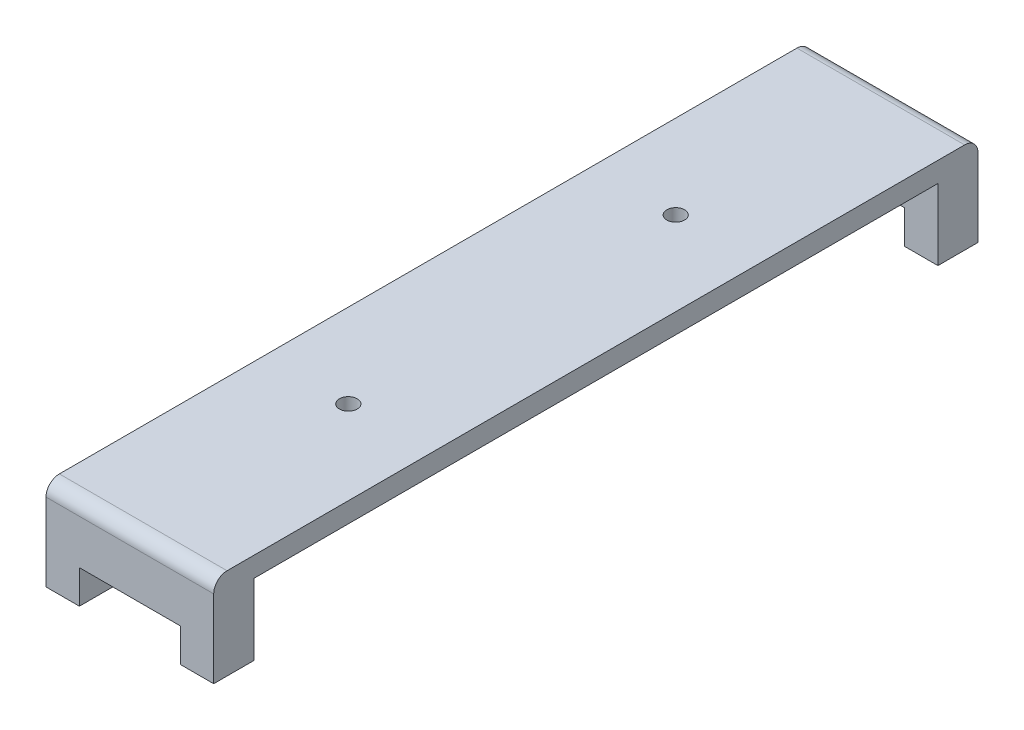
ISO-10303-21;
HEADER;
FILE_DESCRIPTION(('STEP AP214'),'2;1');
FILE_NAME('part.step','',(''),(''),'','','');
FILE_SCHEMA(('AUTOMOTIVE_DESIGN { 1 0 10303 214 1 1 1 1 }'));
ENDSEC;
DATA;
#1=APPLICATION_CONTEXT('core data for automotive mechanical design processes');
#2=APPLICATION_PROTOCOL_DEFINITION('international standard','automotive_design',2000,#1);
#3=PRODUCT_CONTEXT('',#1,'mechanical');
#4=PRODUCT('Part','Part','',(#3));
#5=PRODUCT_RELATED_PRODUCT_CATEGORY('part','',(#4));
#6=PRODUCT_DEFINITION_FORMATION('','',#4);
#7=PRODUCT_DEFINITION_CONTEXT('part definition',#1,'design');
#8=PRODUCT_DEFINITION('design','',#6,#7);
#9=PRODUCT_DEFINITION_SHAPE('','',#8);
#10=(LENGTH_UNIT() NAMED_UNIT(*) SI_UNIT(.MILLI.,.METRE.));
#11=(NAMED_UNIT(*) PLANE_ANGLE_UNIT() SI_UNIT($,.RADIAN.));
#12=(NAMED_UNIT(*) SI_UNIT($,.STERADIAN.) SOLID_ANGLE_UNIT());
#13=UNCERTAINTY_MEASURE_WITH_UNIT(LENGTH_MEASURE(1.E-05),#10,'distance_accuracy_value','');
#14=(GEOMETRIC_REPRESENTATION_CONTEXT(3) GLOBAL_UNCERTAINTY_ASSIGNED_CONTEXT((#13)) GLOBAL_UNIT_ASSIGNED_CONTEXT((#10,
#11,#12)) REPRESENTATION_CONTEXT('',''));
#15=CARTESIAN_POINT('',(0.,0.,0.));
#16=DIRECTION('',(0.,0.,1.));
#17=DIRECTION('',(1.,0.,0.));
#18=AXIS2_PLACEMENT_3D('',#15,#16,#17);
#19=CARTESIAN_POINT('',(0.,0.,0.));
#20=DIRECTION('',(0.,1.,0.));
#21=DIRECTION('',(0.,0.,1.));
#22=AXIS2_PLACEMENT_3D('',#19,#20,#21);
#23=PLANE('',#22);
#24=CARTESIAN_POINT('',(0.,0.,24.5));
#25=DIRECTION('',(0.,-1.,0.));
#26=DIRECTION('',(0.,0.,-1.));
#27=AXIS2_PLACEMENT_3D('',#24,#25,#26);
#28=CIRCLE('',#27,1.335);
#29=CARTESIAN_POINT('',(0.,0.,23.165));
#30=VERTEX_POINT('',#29);
#31=EDGE_CURVE('E213',#30,#30,#28,.T.);
#32=ORIENTED_EDGE('',*,*,#31,.F.);
#33=EDGE_LOOP('',(#32));
#34=FACE_BOUND('',#33,.T.);
#35=CARTESIAN_POINT('',(0.,0.,-24.5));
#36=DIRECTION('',(0.,1.,0.));
#37=DIRECTION('',(0.,0.,1.));
#38=AXIS2_PLACEMENT_3D('',#35,#36,#37);
#39=CIRCLE('',#38,1.335);
#40=CARTESIAN_POINT('',(0.,0.,-23.165));
#41=VERTEX_POINT('',#40);
#42=EDGE_CURVE('E310',#41,#41,#39,.T.);
#43=ORIENTED_EDGE('',*,*,#42,.T.);
#44=EDGE_LOOP('',(#43));
#45=FACE_BOUND('',#44,.T.);
#46=DIRECTION('',(-1.,0.,0.));
#47=VECTOR('',#46,1.);
#48=CARTESIAN_POINT('',(0.,0.,51.2));
#49=LINE('',#48,#47);
#50=CARTESIAN_POINT('',(12.55,0.,51.2));
#51=VERTEX_POINT('',#50);
#52=CARTESIAN_POINT('',(-12.55,0.,51.2));
#53=VERTEX_POINT('',#52);
#54=EDGE_CURVE('E194',#51,#53,#49,.T.);
#55=ORIENTED_EDGE('',*,*,#54,.T.);
#56=DIRECTION('',(0.,0.,1.));
#57=VECTOR('',#56,1.);
#58=CARTESIAN_POINT('',(-12.55,0.,0.));
#59=LINE('',#58,#57);
#60=CARTESIAN_POINT('',(-12.55,0.,-51.2));
#61=VERTEX_POINT('',#60);
#62=EDGE_CURVE('E252',#61,#53,#59,.T.);
#63=ORIENTED_EDGE('',*,*,#62,.F.);
#64=DIRECTION('',(-1.,0.,0.));
#65=VECTOR('',#64,1.);
#66=CARTESIAN_POINT('',(0.,0.,-51.2));
#67=LINE('',#66,#65);
#68=CARTESIAN_POINT('',(12.55,0.,-51.2));
#69=VERTEX_POINT('',#68);
#70=EDGE_CURVE('E247',#69,#61,#67,.T.);
#71=ORIENTED_EDGE('',*,*,#70,.F.);
#72=DIRECTION('',(0.,0.,1.));
#73=VECTOR('',#72,1.);
#74=CARTESIAN_POINT('',(12.55,0.,0.));
#75=LINE('',#74,#73);
#76=EDGE_CURVE('E313',#69,#51,#75,.T.);
#77=ORIENTED_EDGE('',*,*,#76,.T.);
#78=EDGE_LOOP('',(#55,#63,#71,#77));
#79=FACE_BOUND('',#78,.T.);
#80=ADVANCED_FACE('F33',(#34,#45,#79),#23,.F.);
#81=CARTESIAN_POINT('',(12.55,3.,0.));
#82=DIRECTION('',(1.,0.,0.));
#83=DIRECTION('',(0.,0.,-1.));
#84=AXIS2_PLACEMENT_3D('',#81,#82,#83);
#85=PLANE('',#84);
#86=DIRECTION('',(0.,-1.,0.));
#87=VECTOR('',#86,1.);
#88=CARTESIAN_POINT('',(12.55,3.,-57.2));
#89=LINE('',#88,#87);
#90=CARTESIAN_POINT('',(12.55,1.,-57.2));
#91=VERTEX_POINT('',#90);
#92=CARTESIAN_POINT('',(12.55,-10.65,-57.2));
#93=VERTEX_POINT('',#92);
#94=EDGE_CURVE('E266',#91,#93,#89,.T.);
#95=ORIENTED_EDGE('',*,*,#94,.F.);
#96=CARTESIAN_POINT('',(12.55,1.,-55.2));
#97=DIRECTION('',(1.,0.,0.));
#98=DIRECTION('',(0.,0.,-1.));
#99=AXIS2_PLACEMENT_3D('',#96,#97,#98);
#100=CIRCLE('',#99,2.);
#101=CARTESIAN_POINT('',(12.55,3.,-55.2));
#102=VERTEX_POINT('',#101);
#103=EDGE_CURVE('E268',#91,#102,#100,.T.);
#104=ORIENTED_EDGE('',*,*,#103,.T.);
#105=DIRECTION('',(0.,0.,1.));
#106=VECTOR('',#105,1.);
#107=CARTESIAN_POINT('',(12.55,3.,0.));
#108=LINE('',#107,#106);
#109=CARTESIAN_POINT('',(12.55,3.,55.2));
#110=VERTEX_POINT('',#109);
#111=EDGE_CURVE('E297',#102,#110,#108,.T.);
#112=ORIENTED_EDGE('',*,*,#111,.T.);
#113=CARTESIAN_POINT('',(12.55,1.,55.2));
#114=DIRECTION('',(1.,0.,0.));
#115=DIRECTION('',(0.,0.,-1.));
#116=AXIS2_PLACEMENT_3D('',#113,#114,#115);
#117=CIRCLE('',#116,2.);
#118=CARTESIAN_POINT('',(12.55,1.,57.2));
#119=VERTEX_POINT('',#118);
#120=EDGE_CURVE('E265',#110,#119,#117,.T.);
#121=ORIENTED_EDGE('',*,*,#120,.T.);
#122=DIRECTION('',(0.,-1.,0.));
#123=VECTOR('',#122,1.);
#124=CARTESIAN_POINT('',(12.55,3.,57.2));
#125=LINE('',#124,#123);
#126=CARTESIAN_POINT('',(12.55,-10.65,57.2));
#127=VERTEX_POINT('',#126);
#128=EDGE_CURVE('E226',#119,#127,#125,.T.);
#129=ORIENTED_EDGE('',*,*,#128,.T.);
#130=DIRECTION('',(0.,0.,1.));
#131=VECTOR('',#130,1.);
#132=CARTESIAN_POINT('',(12.55,-10.65,51.2));
#133=LINE('',#132,#131);
#134=CARTESIAN_POINT('',(12.55,-10.65,51.2));
#135=VERTEX_POINT('',#134);
#136=EDGE_CURVE('E219',#135,#127,#133,.T.);
#137=ORIENTED_EDGE('',*,*,#136,.F.);
#138=DIRECTION('',(0.,1.,0.));
#139=VECTOR('',#138,1.);
#140=CARTESIAN_POINT('',(12.55,0.,51.2));
#141=LINE('',#140,#139);
#142=EDGE_CURVE('E191',#135,#51,#141,.T.);
#143=ORIENTED_EDGE('',*,*,#142,.T.);
#144=ORIENTED_EDGE('',*,*,#76,.F.);
#145=DIRECTION('',(0.,1.,0.));
#146=VECTOR('',#145,1.);
#147=CARTESIAN_POINT('',(12.55,0.,-51.2));
#148=LINE('',#147,#146);
#149=CARTESIAN_POINT('',(12.55,-10.65,-51.2));
#150=VERTEX_POINT('',#149);
#151=EDGE_CURVE('E251',#150,#69,#148,.T.);
#152=ORIENTED_EDGE('',*,*,#151,.F.);
#153=DIRECTION('',(0.,0.,-1.));
#154=VECTOR('',#153,1.);
#155=CARTESIAN_POINT('',(12.55,-10.65,-51.2));
#156=LINE('',#155,#154);
#157=EDGE_CURVE('E327',#150,#93,#156,.T.);
#158=ORIENTED_EDGE('',*,*,#157,.T.);
#159=EDGE_LOOP('',(#95,#104,#112,#121,#129,#137,#143,#144,#152,#158));
#160=FACE_BOUND('',#159,.T.);
#161=ADVANCED_FACE('F296',(#160),#85,.T.);
#162=CARTESIAN_POINT('',(0.,3.,-57.2));
#163=DIRECTION('',(0.,0.,-1.));
#164=DIRECTION('',(-1.,0.,0.));
#165=AXIS2_PLACEMENT_3D('',#162,#163,#164);
#166=PLANE('',#165);
#167=DIRECTION('',(0.,-1.,0.));
#168=VECTOR('',#167,1.);
#169=CARTESIAN_POINT('',(-12.55,3.,-57.2));
#170=LINE('',#169,#168);
#171=CARTESIAN_POINT('',(-12.55,1.,-57.2));
#172=VERTEX_POINT('',#171);
#173=CARTESIAN_POINT('',(-12.55,-10.65,-57.2));
#174=VERTEX_POINT('',#173);
#175=EDGE_CURVE('E279',#172,#174,#170,.T.);
#176=ORIENTED_EDGE('',*,*,#175,.F.);
#177=DIRECTION('',(1.,0.,0.));
#178=VECTOR('',#177,1.);
#179=CARTESIAN_POINT('',(0.,1.,-57.2));
#180=LINE('',#179,#178);
#181=EDGE_CURVE('E262',#172,#91,#180,.T.);
#182=ORIENTED_EDGE('',*,*,#181,.T.);
#183=ORIENTED_EDGE('',*,*,#94,.T.);
#184=DIRECTION('',(1.,0.,0.));
#185=VECTOR('',#184,1.);
#186=CARTESIAN_POINT('',(0.,-10.65,-57.2));
#187=LINE('',#186,#185);
#188=CARTESIAN_POINT('',(7.55,-10.65,-57.2));
#189=VERTEX_POINT('',#188);
#190=EDGE_CURVE('E321',#189,#93,#187,.T.);
#191=ORIENTED_EDGE('',*,*,#190,.F.);
#192=DIRECTION('',(0.,-1.,0.));
#193=VECTOR('',#192,1.);
#194=CARTESIAN_POINT('',(7.55,0.,-57.2));
#195=LINE('',#194,#193);
#196=CARTESIAN_POINT('',(7.55,-5.65,-57.2));
#197=VERTEX_POINT('',#196);
#198=EDGE_CURVE('E237',#197,#189,#195,.T.);
#199=ORIENTED_EDGE('',*,*,#198,.F.);
#200=DIRECTION('',(1.,0.,0.));
#201=VECTOR('',#200,1.);
#202=CARTESIAN_POINT('',(0.,-5.65,-57.2));
#203=LINE('',#202,#201);
#204=CARTESIAN_POINT('',(-7.55,-5.65,-57.2));
#205=VERTEX_POINT('',#204);
#206=EDGE_CURVE('E232',#205,#197,#203,.T.);
#207=ORIENTED_EDGE('',*,*,#206,.F.);
#208=DIRECTION('',(0.,1.,0.));
#209=VECTOR('',#208,1.);
#210=CARTESIAN_POINT('',(-7.55,0.,-57.2));
#211=LINE('',#210,#209);
#212=CARTESIAN_POINT('',(-7.55,-10.65,-57.2));
#213=VERTEX_POINT('',#212);
#214=EDGE_CURVE('E352',#213,#205,#211,.T.);
#215=ORIENTED_EDGE('',*,*,#214,.F.);
#216=DIRECTION('',(1.,0.,0.));
#217=VECTOR('',#216,1.);
#218=CARTESIAN_POINT('',(0.,-10.65,-57.2));
#219=LINE('',#218,#217);
#220=EDGE_CURVE('E290',#174,#213,#219,.T.);
#221=ORIENTED_EDGE('',*,*,#220,.F.);
#222=EDGE_LOOP('',(#176,#182,#183,#191,#199,#207,#215,#221));
#223=FACE_BOUND('',#222,.T.);
#224=ADVANCED_FACE('F287',(#223),#166,.T.);
#225=CARTESIAN_POINT('',(-12.55,3.,0.));
#226=DIRECTION('',(1.,0.,0.));
#227=DIRECTION('',(0.,0.,-1.));
#228=AXIS2_PLACEMENT_3D('',#225,#226,#227);
#229=PLANE('',#228);
#230=DIRECTION('',(0.,0.,1.));
#231=VECTOR('',#230,1.);
#232=CARTESIAN_POINT('',(-12.55,3.,0.));
#233=LINE('',#232,#231);
#234=CARTESIAN_POINT('',(-12.55,3.,-55.2));
#235=VERTEX_POINT('',#234);
#236=CARTESIAN_POINT('',(-12.55,3.,55.2));
#237=VERTEX_POINT('',#236);
#238=EDGE_CURVE('E281',#235,#237,#233,.T.);
#239=ORIENTED_EDGE('',*,*,#238,.F.);
#240=CARTESIAN_POINT('',(-12.55,1.,-55.2));
#241=DIRECTION('',(1.,0.,0.));
#242=DIRECTION('',(0.,0.,-1.));
#243=AXIS2_PLACEMENT_3D('',#240,#241,#242);
#244=CIRCLE('',#243,2.);
#245=EDGE_CURVE('E41',#235,#172,#244,.F.);
#246=ORIENTED_EDGE('',*,*,#245,.T.);
#247=ORIENTED_EDGE('',*,*,#175,.T.);
#248=DIRECTION('',(0.,0.,-1.));
#249=VECTOR('',#248,1.);
#250=CARTESIAN_POINT('',(-12.55,-10.65,-51.2));
#251=LINE('',#250,#249);
#252=CARTESIAN_POINT('',(-12.55,-10.65,-51.2));
#253=VERTEX_POINT('',#252);
#254=EDGE_CURVE('E333',#253,#174,#251,.T.);
#255=ORIENTED_EDGE('',*,*,#254,.F.);
#256=DIRECTION('',(0.,-1.,0.));
#257=VECTOR('',#256,1.);
#258=CARTESIAN_POINT('',(-12.55,0.,-51.2));
#259=LINE('',#258,#257);
#260=EDGE_CURVE('E241',#61,#253,#259,.T.);
#261=ORIENTED_EDGE('',*,*,#260,.F.);
#262=ORIENTED_EDGE('',*,*,#62,.T.);
#263=DIRECTION('',(0.,-1.,0.));
#264=VECTOR('',#263,1.);
#265=CARTESIAN_POINT('',(-12.55,0.,51.2));
#266=LINE('',#265,#264);
#267=CARTESIAN_POINT('',(-12.55,-10.65,51.2));
#268=VERTEX_POINT('',#267);
#269=EDGE_CURVE('E197',#53,#268,#266,.T.);
#270=ORIENTED_EDGE('',*,*,#269,.T.);
#271=DIRECTION('',(0.,0.,1.));
#272=VECTOR('',#271,1.);
#273=CARTESIAN_POINT('',(-12.55,-10.65,51.2));
#274=LINE('',#273,#272);
#275=CARTESIAN_POINT('',(-12.55,-10.65,57.2));
#276=VERTEX_POINT('',#275);
#277=EDGE_CURVE('E216',#268,#276,#274,.T.);
#278=ORIENTED_EDGE('',*,*,#277,.T.);
#279=DIRECTION('',(0.,-1.,0.));
#280=VECTOR('',#279,1.);
#281=CARTESIAN_POINT('',(-12.55,3.,57.2));
#282=LINE('',#281,#280);
#283=CARTESIAN_POINT('',(-12.55,1.,57.2));
#284=VERTEX_POINT('',#283);
#285=EDGE_CURVE('E230',#284,#276,#282,.T.);
#286=ORIENTED_EDGE('',*,*,#285,.F.);
#287=CARTESIAN_POINT('',(-12.55,1.,55.2));
#288=DIRECTION('',(1.,0.,0.));
#289=DIRECTION('',(0.,0.,-1.));
#290=AXIS2_PLACEMENT_3D('',#287,#288,#289);
#291=CIRCLE('',#290,2.);
#292=EDGE_CURVE('E53',#284,#237,#291,.F.);
#293=ORIENTED_EDGE('',*,*,#292,.T.);
#294=EDGE_LOOP('',(#239,#246,#247,#255,#261,#262,#270,#278,#286,#293));
#295=FACE_BOUND('',#294,.T.);
#296=ADVANCED_FACE('F277',(#295),#229,.F.);
#297=CARTESIAN_POINT('',(0.,3.,-24.5));
#298=DIRECTION('',(0.,-1.,0.));
#299=DIRECTION('',(0.,0.,-1.));
#300=AXIS2_PLACEMENT_3D('',#297,#298,#299);
#301=CYLINDRICAL_SURFACE('',#300,1.335);
#302=CARTESIAN_POINT('',(0.,3.,-24.5));
#303=DIRECTION('',(0.,1.,0.));
#304=DIRECTION('',(0.,0.,1.));
#305=AXIS2_PLACEMENT_3D('',#302,#303,#304);
#306=CIRCLE('',#305,1.335);
#307=CARTESIAN_POINT('',(0.,3.,-23.165));
#308=VERTEX_POINT('',#307);
#309=EDGE_CURVE('E303',#308,#308,#306,.T.);
#310=ORIENTED_EDGE('',*,*,#309,.T.);
#311=EDGE_LOOP('',(#310));
#312=FACE_BOUND('',#311,.T.);
#313=ORIENTED_EDGE('',*,*,#42,.F.);
#314=EDGE_LOOP('',(#313));
#315=FACE_BOUND('',#314,.T.);
#316=ADVANCED_FACE('F405',(#312,#315),#301,.F.);
#317=CARTESIAN_POINT('',(0.,3.,0.));
#318=DIRECTION('',(0.,1.,0.));
#319=DIRECTION('',(0.,0.,1.));
#320=AXIS2_PLACEMENT_3D('',#317,#318,#319);
#321=PLANE('',#320);
#322=ORIENTED_EDGE('',*,*,#309,.F.);
#323=EDGE_LOOP('',(#322));
#324=FACE_BOUND('',#323,.T.);
#325=ORIENTED_EDGE('',*,*,#111,.F.);
#326=DIRECTION('',(1.,0.,0.));
#327=VECTOR('',#326,1.);
#328=CARTESIAN_POINT('',(0.,3.,-55.2));
#329=LINE('',#328,#327);
#330=EDGE_CURVE('E273',#102,#235,#329,.F.);
#331=ORIENTED_EDGE('',*,*,#330,.T.);
#332=ORIENTED_EDGE('',*,*,#238,.T.);
#333=DIRECTION('',(1.,0.,0.));
#334=VECTOR('',#333,1.);
#335=CARTESIAN_POINT('',(12.55,3.,55.2));
#336=LINE('',#335,#334);
#337=EDGE_CURVE('E270',#237,#110,#336,.T.);
#338=ORIENTED_EDGE('',*,*,#337,.T.);
#339=EDGE_LOOP('',(#325,#331,#332,#338));
#340=FACE_BOUND('',#339,.T.);
#341=CARTESIAN_POINT('',(0.,3.,24.5));
#342=DIRECTION('',(0.,-1.,0.));
#343=DIRECTION('',(0.,0.,-1.));
#344=AXIS2_PLACEMENT_3D('',#341,#342,#343);
#345=CIRCLE('',#344,1.335);
#346=CARTESIAN_POINT('',(0.,3.,23.165));
#347=VERTEX_POINT('',#346);
#348=EDGE_CURVE('E223',#347,#347,#345,.T.);
#349=ORIENTED_EDGE('',*,*,#348,.T.);
#350=EDGE_LOOP('',(#349));
#351=FACE_BOUND('',#350,.T.);
#352=ADVANCED_FACE('F300',(#324,#340,#351),#321,.T.);
#353=CARTESIAN_POINT('',(0.,-5.65,-51.2));
#354=DIRECTION('',(0.,1.,0.));
#355=DIRECTION('',(-1.,0.,0.));
#356=AXIS2_PLACEMENT_3D('',#353,#354,#355);
#357=PLANE('',#356);
#358=ORIENTED_EDGE('',*,*,#206,.T.);
#359=DIRECTION('',(0.,0.,-1.));
#360=VECTOR('',#359,1.);
#361=CARTESIAN_POINT('',(7.55,-5.65,-51.2));
#362=LINE('',#361,#360);
#363=CARTESIAN_POINT('',(7.55,-5.65,-51.2));
#364=VERTEX_POINT('',#363);
#365=EDGE_CURVE('E314',#364,#197,#362,.T.);
#366=ORIENTED_EDGE('',*,*,#365,.F.);
#367=DIRECTION('',(1.,0.,0.));
#368=VECTOR('',#367,1.);
#369=CARTESIAN_POINT('',(0.,-5.65,-51.2));
#370=LINE('',#369,#368);
#371=CARTESIAN_POINT('',(-7.55,-5.65,-51.2));
#372=VERTEX_POINT('',#371);
#373=EDGE_CURVE('E233',#372,#364,#370,.T.);
#374=ORIENTED_EDGE('',*,*,#373,.F.);
#375=DIRECTION('',(0.,0.,-1.));
#376=VECTOR('',#375,1.);
#377=CARTESIAN_POINT('',(-7.55,-5.65,-51.2));
#378=LINE('',#377,#376);
#379=EDGE_CURVE('E341',#372,#205,#378,.T.);
#380=ORIENTED_EDGE('',*,*,#379,.T.);
#381=EDGE_LOOP('',(#358,#366,#374,#380));
#382=FACE_BOUND('',#381,.T.);
#383=ADVANCED_FACE('F359',(#382),#357,.F.);
#384=CARTESIAN_POINT('',(7.55,0.,-51.2));
#385=DIRECTION('',(1.,0.,0.));
#386=DIRECTION('',(0.,0.,-1.));
#387=AXIS2_PLACEMENT_3D('',#384,#385,#386);
#388=PLANE('',#387);
#389=ORIENTED_EDGE('',*,*,#198,.T.);
#390=DIRECTION('',(0.,0.,-1.));
#391=VECTOR('',#390,1.);
#392=CARTESIAN_POINT('',(7.55,-10.65,-51.2));
#393=LINE('',#392,#391);
#394=CARTESIAN_POINT('',(7.55,-10.65,-51.2));
#395=VERTEX_POINT('',#394);
#396=EDGE_CURVE('E330',#395,#189,#393,.T.);
#397=ORIENTED_EDGE('',*,*,#396,.F.);
#398=DIRECTION('',(0.,-1.,0.));
#399=VECTOR('',#398,1.);
#400=CARTESIAN_POINT('',(7.55,0.,-51.2));
#401=LINE('',#400,#399);
#402=EDGE_CURVE('E343',#364,#395,#401,.T.);
#403=ORIENTED_EDGE('',*,*,#402,.F.);
#404=ORIENTED_EDGE('',*,*,#365,.T.);
#405=EDGE_LOOP('',(#389,#397,#403,#404));
#406=FACE_BOUND('',#405,.T.);
#407=ADVANCED_FACE('F358',(#406),#388,.F.);
#408=CARTESIAN_POINT('',(0.,-10.65,-51.2));
#409=DIRECTION('',(0.,1.,0.));
#410=DIRECTION('',(-1.,0.,0.));
#411=AXIS2_PLACEMENT_3D('',#408,#409,#410);
#412=PLANE('',#411);
#413=ORIENTED_EDGE('',*,*,#190,.T.);
#414=ORIENTED_EDGE('',*,*,#157,.F.);
#415=DIRECTION('',(1.,0.,0.));
#416=VECTOR('',#415,1.);
#417=CARTESIAN_POINT('',(0.,-10.65,-51.2));
#418=LINE('',#417,#416);
#419=EDGE_CURVE('E244',#395,#150,#418,.T.);
#420=ORIENTED_EDGE('',*,*,#419,.F.);
#421=ORIENTED_EDGE('',*,*,#396,.T.);
#422=EDGE_LOOP('',(#413,#414,#420,#421));
#423=FACE_BOUND('',#422,.T.);
#424=ADVANCED_FACE('F325',(#423),#412,.F.);
#425=CARTESIAN_POINT('',(0.,-10.65,-51.2));
#426=DIRECTION('',(0.,1.,0.));
#427=DIRECTION('',(0.,0.,1.));
#428=AXIS2_PLACEMENT_3D('',#425,#426,#427);
#429=PLANE('',#428);
#430=ORIENTED_EDGE('',*,*,#220,.T.);
#431=DIRECTION('',(0.,0.,-1.));
#432=VECTOR('',#431,1.);
#433=CARTESIAN_POINT('',(-7.55,-10.65,-51.2));
#434=LINE('',#433,#432);
#435=CARTESIAN_POINT('',(-7.55,-10.65,-51.2));
#436=VERTEX_POINT('',#435);
#437=EDGE_CURVE('E336',#436,#213,#434,.T.);
#438=ORIENTED_EDGE('',*,*,#437,.F.);
#439=DIRECTION('',(1.,0.,0.));
#440=VECTOR('',#439,1.);
#441=CARTESIAN_POINT('',(0.,-10.65,-51.2));
#442=LINE('',#441,#440);
#443=EDGE_CURVE('E239',#253,#436,#442,.T.);
#444=ORIENTED_EDGE('',*,*,#443,.F.);
#445=ORIENTED_EDGE('',*,*,#254,.T.);
#446=EDGE_LOOP('',(#430,#438,#444,#445));
#447=FACE_BOUND('',#446,.T.);
#448=ADVANCED_FACE('F366',(#447),#429,.F.);
#449=CARTESIAN_POINT('',(-7.55,0.,-51.2));
#450=DIRECTION('',(-1.,0.,0.));
#451=DIRECTION('',(0.,-1.,0.));
#452=AXIS2_PLACEMENT_3D('',#449,#450,#451);
#453=PLANE('',#452);
#454=ORIENTED_EDGE('',*,*,#214,.T.);
#455=ORIENTED_EDGE('',*,*,#379,.F.);
#456=DIRECTION('',(0.,1.,0.));
#457=VECTOR('',#456,1.);
#458=CARTESIAN_POINT('',(-7.55,0.,-51.2));
#459=LINE('',#458,#457);
#460=EDGE_CURVE('E236',#436,#372,#459,.T.);
#461=ORIENTED_EDGE('',*,*,#460,.F.);
#462=ORIENTED_EDGE('',*,*,#437,.T.);
#463=EDGE_LOOP('',(#454,#455,#461,#462));
#464=FACE_BOUND('',#463,.T.);
#465=ADVANCED_FACE('F361',(#464),#453,.F.);
#466=CARTESIAN_POINT('',(0.,0.,-51.2));
#467=DIRECTION('',(0.,0.,-1.));
#468=DIRECTION('',(-1.,0.,0.));
#469=AXIS2_PLACEMENT_3D('',#466,#467,#468);
#470=PLANE('',#469);
#471=ORIENTED_EDGE('',*,*,#373,.T.);
#472=ORIENTED_EDGE('',*,*,#402,.T.);
#473=ORIENTED_EDGE('',*,*,#419,.T.);
#474=ORIENTED_EDGE('',*,*,#151,.T.);
#475=ORIENTED_EDGE('',*,*,#70,.T.);
#476=ORIENTED_EDGE('',*,*,#260,.T.);
#477=ORIENTED_EDGE('',*,*,#443,.T.);
#478=ORIENTED_EDGE('',*,*,#460,.T.);
#479=EDGE_LOOP('',(#471,#472,#473,#474,#475,#476,#477,#478));
#480=FACE_BOUND('',#479,.T.);
#481=ADVANCED_FACE('F369',(#480),#470,.F.);
#482=CARTESIAN_POINT('',(0.,3.,24.5));
#483=DIRECTION('',(0.,-1.,0.));
#484=DIRECTION('',(0.,0.,-1.));
#485=AXIS2_PLACEMENT_3D('',#482,#483,#484);
#486=CYLINDRICAL_SURFACE('',#485,1.335);
#487=ORIENTED_EDGE('',*,*,#348,.F.);
#488=EDGE_LOOP('',(#487));
#489=FACE_BOUND('',#488,.T.);
#490=ORIENTED_EDGE('',*,*,#31,.T.);
#491=EDGE_LOOP('',(#490));
#492=FACE_BOUND('',#491,.T.);
#493=ADVANCED_FACE('F428',(#489,#492),#486,.F.);
#494=CARTESIAN_POINT('',(0.,3.,57.2));
#495=DIRECTION('',(0.,0.,-1.));
#496=DIRECTION('',(-1.,0.,0.));
#497=AXIS2_PLACEMENT_3D('',#494,#495,#496);
#498=PLANE('',#497);
#499=ORIENTED_EDGE('',*,*,#128,.F.);
#500=DIRECTION('',(1.,0.,0.));
#501=VECTOR('',#500,1.);
#502=CARTESIAN_POINT('',(-12.55,1.,57.2));
#503=LINE('',#502,#501);
#504=EDGE_CURVE('E11',#119,#284,#503,.F.);
#505=ORIENTED_EDGE('',*,*,#504,.T.);
#506=ORIENTED_EDGE('',*,*,#285,.T.);
#507=DIRECTION('',(1.,0.,0.));
#508=VECTOR('',#507,1.);
#509=CARTESIAN_POINT('',(0.,-10.65,57.2));
#510=LINE('',#509,#508);
#511=CARTESIAN_POINT('',(-7.55,-10.65,57.2));
#512=VERTEX_POINT('',#511);
#513=EDGE_CURVE('E187',#276,#512,#510,.T.);
#514=ORIENTED_EDGE('',*,*,#513,.T.);
#515=DIRECTION('',(0.,1.,0.));
#516=VECTOR('',#515,1.);
#517=CARTESIAN_POINT('',(-7.55,0.,57.2));
#518=LINE('',#517,#516);
#519=CARTESIAN_POINT('',(-7.55,-5.65,57.2));
#520=VERTEX_POINT('',#519);
#521=EDGE_CURVE('E184',#512,#520,#518,.T.);
#522=ORIENTED_EDGE('',*,*,#521,.T.);
#523=DIRECTION('',(1.,0.,0.));
#524=VECTOR('',#523,1.);
#525=CARTESIAN_POINT('',(0.,-5.65,57.2));
#526=LINE('',#525,#524);
#527=CARTESIAN_POINT('',(7.55,-5.65,57.2));
#528=VERTEX_POINT('',#527);
#529=EDGE_CURVE('E204',#520,#528,#526,.T.);
#530=ORIENTED_EDGE('',*,*,#529,.T.);
#531=DIRECTION('',(0.,-1.,0.));
#532=VECTOR('',#531,1.);
#533=CARTESIAN_POINT('',(7.55,0.,57.2));
#534=LINE('',#533,#532);
#535=CARTESIAN_POINT('',(7.55,-10.65,57.2));
#536=VERTEX_POINT('',#535);
#537=EDGE_CURVE('E163',#528,#536,#534,.T.);
#538=ORIENTED_EDGE('',*,*,#537,.T.);
#539=DIRECTION('',(1.,0.,0.));
#540=VECTOR('',#539,1.);
#541=CARTESIAN_POINT('',(0.,-10.65,57.2));
#542=LINE('',#541,#540);
#543=EDGE_CURVE('E207',#536,#127,#542,.T.);
#544=ORIENTED_EDGE('',*,*,#543,.T.);
#545=EDGE_LOOP('',(#499,#505,#506,#514,#522,#530,#538,#544));
#546=FACE_BOUND('',#545,.T.);
#547=ADVANCED_FACE('F374',(#546),#498,.F.);
#548=CARTESIAN_POINT('',(0.,-5.65,51.2));
#549=DIRECTION('',(0.,-1.,0.));
#550=DIRECTION('',(1.,0.,0.));
#551=AXIS2_PLACEMENT_3D('',#548,#549,#550);
#552=PLANE('',#551);
#553=ORIENTED_EDGE('',*,*,#529,.F.);
#554=DIRECTION('',(0.,0.,1.));
#555=VECTOR('',#554,1.);
#556=CARTESIAN_POINT('',(-7.55,-5.65,51.2));
#557=LINE('',#556,#555);
#558=CARTESIAN_POINT('',(-7.55,-5.65,51.2));
#559=VERTEX_POINT('',#558);
#560=EDGE_CURVE('E183',#559,#520,#557,.T.);
#561=ORIENTED_EDGE('',*,*,#560,.F.);
#562=DIRECTION('',(1.,0.,0.));
#563=VECTOR('',#562,1.);
#564=CARTESIAN_POINT('',(0.,-5.65,51.2));
#565=LINE('',#564,#563);
#566=CARTESIAN_POINT('',(7.55,-5.65,51.2));
#567=VERTEX_POINT('',#566);
#568=EDGE_CURVE('E176',#559,#567,#565,.T.);
#569=ORIENTED_EDGE('',*,*,#568,.T.);
#570=DIRECTION('',(0.,0.,1.));
#571=VECTOR('',#570,1.);
#572=CARTESIAN_POINT('',(7.55,-5.65,51.2));
#573=LINE('',#572,#571);
#574=EDGE_CURVE('E158',#567,#528,#573,.T.);
#575=ORIENTED_EDGE('',*,*,#574,.T.);
#576=EDGE_LOOP('',(#553,#561,#569,#575));
#577=FACE_BOUND('',#576,.T.);
#578=ADVANCED_FACE('F182',(#577),#552,.T.);
#579=CARTESIAN_POINT('',(-7.55,0.,51.2));
#580=DIRECTION('',(1.,0.,0.));
#581=DIRECTION('',(0.,1.,0.));
#582=AXIS2_PLACEMENT_3D('',#579,#580,#581);
#583=PLANE('',#582);
#584=ORIENTED_EDGE('',*,*,#521,.F.);
#585=DIRECTION('',(0.,0.,1.));
#586=VECTOR('',#585,1.);
#587=CARTESIAN_POINT('',(-7.55,-10.65,51.2));
#588=LINE('',#587,#586);
#589=CARTESIAN_POINT('',(-7.55,-10.65,51.2));
#590=VERTEX_POINT('',#589);
#591=EDGE_CURVE('E214',#590,#512,#588,.T.);
#592=ORIENTED_EDGE('',*,*,#591,.F.);
#593=DIRECTION('',(0.,1.,0.));
#594=VECTOR('',#593,1.);
#595=CARTESIAN_POINT('',(-7.55,0.,51.2));
#596=LINE('',#595,#594);
#597=EDGE_CURVE('E169',#590,#559,#596,.T.);
#598=ORIENTED_EDGE('',*,*,#597,.T.);
#599=ORIENTED_EDGE('',*,*,#560,.T.);
#600=EDGE_LOOP('',(#584,#592,#598,#599));
#601=FACE_BOUND('',#600,.T.);
#602=ADVANCED_FACE('F378',(#601),#583,.T.);
#603=CARTESIAN_POINT('',(0.,-10.65,51.2));
#604=DIRECTION('',(0.,-1.,0.));
#605=DIRECTION('',(0.,0.,-1.));
#606=AXIS2_PLACEMENT_3D('',#603,#604,#605);
#607=PLANE('',#606);
#608=ORIENTED_EDGE('',*,*,#513,.F.);
#609=ORIENTED_EDGE('',*,*,#277,.F.);
#610=DIRECTION('',(1.,0.,0.));
#611=VECTOR('',#610,1.);
#612=CARTESIAN_POINT('',(0.,-10.65,51.2));
#613=LINE('',#612,#611);
#614=EDGE_CURVE('E200',#268,#590,#613,.T.);
#615=ORIENTED_EDGE('',*,*,#614,.T.);
#616=ORIENTED_EDGE('',*,*,#591,.T.);
#617=EDGE_LOOP('',(#608,#609,#615,#616));
#618=FACE_BOUND('',#617,.T.);
#619=ADVANCED_FACE('F381',(#618),#607,.T.);
#620=CARTESIAN_POINT('',(0.,-10.65,51.2));
#621=DIRECTION('',(0.,-1.,0.));
#622=DIRECTION('',(1.,0.,0.));
#623=AXIS2_PLACEMENT_3D('',#620,#621,#622);
#624=PLANE('',#623);
#625=ORIENTED_EDGE('',*,*,#543,.F.);
#626=DIRECTION('',(0.,0.,1.));
#627=VECTOR('',#626,1.);
#628=CARTESIAN_POINT('',(7.55,-10.65,51.2));
#629=LINE('',#628,#627);
#630=CARTESIAN_POINT('',(7.55,-10.65,51.2));
#631=VERTEX_POINT('',#630);
#632=EDGE_CURVE('E168',#631,#536,#629,.T.);
#633=ORIENTED_EDGE('',*,*,#632,.F.);
#634=DIRECTION('',(1.,0.,0.));
#635=VECTOR('',#634,1.);
#636=CARTESIAN_POINT('',(0.,-10.65,51.2));
#637=LINE('',#636,#635);
#638=EDGE_CURVE('E180',#631,#135,#637,.T.);
#639=ORIENTED_EDGE('',*,*,#638,.T.);
#640=ORIENTED_EDGE('',*,*,#136,.T.);
#641=EDGE_LOOP('',(#625,#633,#639,#640));
#642=FACE_BOUND('',#641,.T.);
#643=ADVANCED_FACE('F373',(#642),#624,.T.);
#644=CARTESIAN_POINT('',(7.55,0.,51.2));
#645=DIRECTION('',(-1.,0.,0.));
#646=DIRECTION('',(0.,0.,1.));
#647=AXIS2_PLACEMENT_3D('',#644,#645,#646);
#648=PLANE('',#647);
#649=ORIENTED_EDGE('',*,*,#537,.F.);
#650=ORIENTED_EDGE('',*,*,#574,.F.);
#651=DIRECTION('',(0.,-1.,0.));
#652=VECTOR('',#651,1.);
#653=CARTESIAN_POINT('',(7.55,0.,51.2));
#654=LINE('',#653,#652);
#655=EDGE_CURVE('E161',#567,#631,#654,.T.);
#656=ORIENTED_EDGE('',*,*,#655,.T.);
#657=ORIENTED_EDGE('',*,*,#632,.T.);
#658=EDGE_LOOP('',(#649,#650,#656,#657));
#659=FACE_BOUND('',#658,.T.);
#660=ADVANCED_FACE('F160',(#659),#648,.T.);
#661=CARTESIAN_POINT('',(0.,0.,51.2));
#662=DIRECTION('',(0.,0.,1.));
#663=DIRECTION('',(-1.,0.,0.));
#664=AXIS2_PLACEMENT_3D('',#661,#662,#663);
#665=PLANE('',#664);
#666=ORIENTED_EDGE('',*,*,#568,.F.);
#667=ORIENTED_EDGE('',*,*,#597,.F.);
#668=ORIENTED_EDGE('',*,*,#614,.F.);
#669=ORIENTED_EDGE('',*,*,#269,.F.);
#670=ORIENTED_EDGE('',*,*,#54,.F.);
#671=ORIENTED_EDGE('',*,*,#142,.F.);
#672=ORIENTED_EDGE('',*,*,#638,.F.);
#673=ORIENTED_EDGE('',*,*,#655,.F.);
#674=EDGE_LOOP('',(#666,#667,#668,#669,#670,#671,#672,#673));
#675=FACE_BOUND('',#674,.T.);
#676=ADVANCED_FACE('F174',(#675),#665,.F.);
#677=CARTESIAN_POINT('',(0.,1.,-55.2));
#678=DIRECTION('',(1.,0.,0.));
#679=DIRECTION('',(0.,0.,-1.));
#680=AXIS2_PLACEMENT_3D('',#677,#678,#679);
#681=CYLINDRICAL_SURFACE('',#680,2.);
#682=ORIENTED_EDGE('',*,*,#245,.F.);
#683=ORIENTED_EDGE('',*,*,#330,.F.);
#684=ORIENTED_EDGE('',*,*,#103,.F.);
#685=ORIENTED_EDGE('',*,*,#181,.F.);
#686=EDGE_LOOP('',(#682,#683,#684,#685));
#687=FACE_BOUND('',#686,.T.);
#688=ADVANCED_FACE('F292',(#687),#681,.T.);
#689=CARTESIAN_POINT('',(0.,1.,55.2));
#690=DIRECTION('',(-1.,0.,0.));
#691=DIRECTION('',(0.,0.,1.));
#692=AXIS2_PLACEMENT_3D('',#689,#690,#691);
#693=CYLINDRICAL_SURFACE('',#692,2.);
#694=ORIENTED_EDGE('',*,*,#292,.F.);
#695=ORIENTED_EDGE('',*,*,#504,.F.);
#696=ORIENTED_EDGE('',*,*,#120,.F.);
#697=ORIENTED_EDGE('',*,*,#337,.F.);
#698=EDGE_LOOP('',(#694,#695,#696,#697));
#699=FACE_BOUND('',#698,.T.);
#700=ADVANCED_FACE('F35',(#699),#693,.T.);
#701=CLOSED_SHELL('',(#80,#161,#224,#296,#316,#352,#383,#407,#424,#448,#465,#481,#493,#547,#578,
#602,#619,#643,#660,#676,#688,#700));
#702=MANIFOLD_SOLID_BREP('B2',#701);
#703=ADVANCED_BREP_SHAPE_REPRESENTATION('',(#18,#702),#14);
#704=SHAPE_DEFINITION_REPRESENTATION(#9,#703);
ENDSEC;
END-ISO-10303-21;
